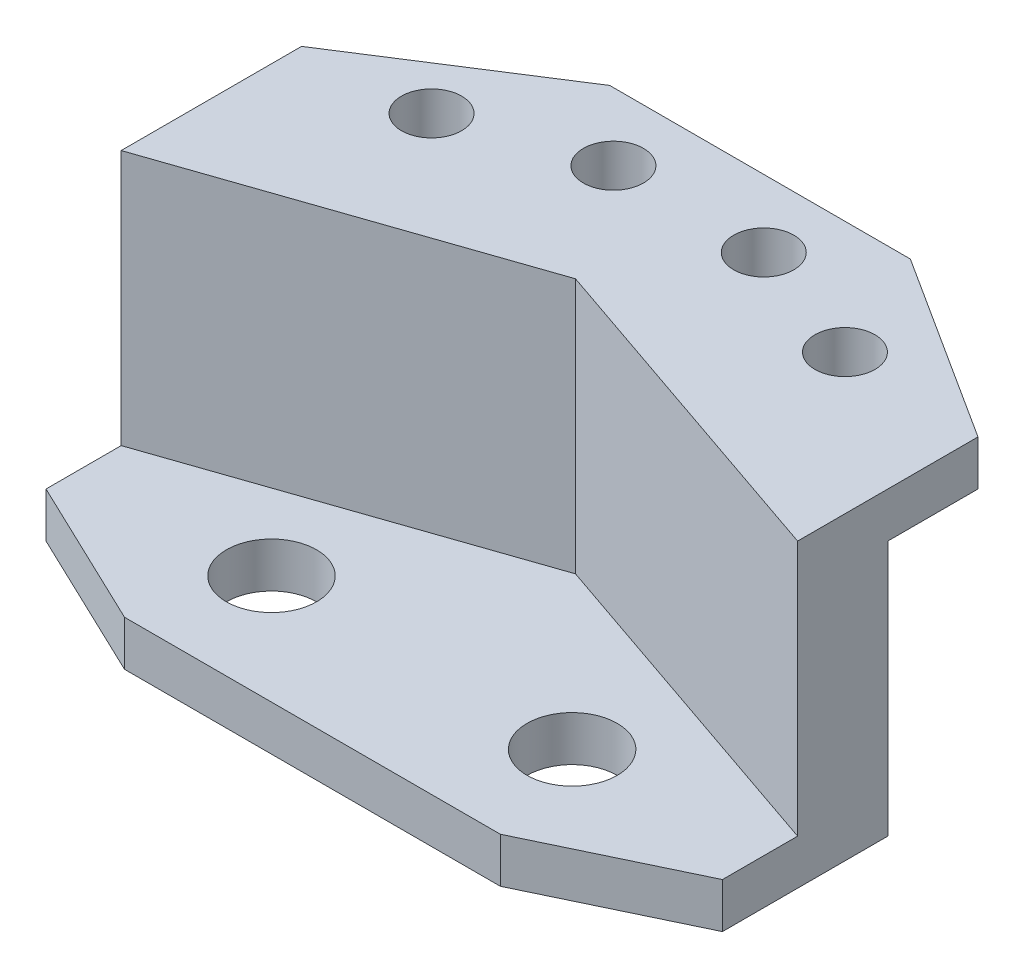
ISO-10303-21;
HEADER;
FILE_DESCRIPTION(('STEP AP214'),'2;1');
FILE_NAME('part.step','',(''),(''),'','','');
FILE_SCHEMA(('AUTOMOTIVE_DESIGN { 1 0 10303 214 1 1 1 1 }'));
ENDSEC;
DATA;
#1=APPLICATION_CONTEXT('core data for automotive mechanical design processes');
#2=APPLICATION_PROTOCOL_DEFINITION('international standard','automotive_design',2000,#1);
#3=PRODUCT_CONTEXT('',#1,'mechanical');
#4=PRODUCT('Part','Part','',(#3));
#5=PRODUCT_RELATED_PRODUCT_CATEGORY('part','',(#4));
#6=PRODUCT_DEFINITION_FORMATION('','',#4);
#7=PRODUCT_DEFINITION_CONTEXT('part definition',#1,'design');
#8=PRODUCT_DEFINITION('design','',#6,#7);
#9=PRODUCT_DEFINITION_SHAPE('','',#8);
#10=(LENGTH_UNIT() NAMED_UNIT(*) SI_UNIT(.MILLI.,.METRE.));
#11=(NAMED_UNIT(*) PLANE_ANGLE_UNIT() SI_UNIT($,.RADIAN.));
#12=(NAMED_UNIT(*) SI_UNIT($,.STERADIAN.) SOLID_ANGLE_UNIT());
#13=UNCERTAINTY_MEASURE_WITH_UNIT(LENGTH_MEASURE(1.E-05),#10,'distance_accuracy_value','');
#14=(GEOMETRIC_REPRESENTATION_CONTEXT(3) GLOBAL_UNCERTAINTY_ASSIGNED_CONTEXT((#13)) GLOBAL_UNIT_ASSIGNED_CONTEXT((#10,
#11,#12)) REPRESENTATION_CONTEXT('',''));
#15=CARTESIAN_POINT('',(0.,0.,0.));
#16=DIRECTION('',(0.,0.,1.));
#17=DIRECTION('',(1.,0.,0.));
#18=AXIS2_PLACEMENT_3D('',#15,#16,#17);
#19=CARTESIAN_POINT('',(0.,6.,0.));
#20=DIRECTION('',(0.,1.,0.));
#21=DIRECTION('',(0.,0.,1.));
#22=AXIS2_PLACEMENT_3D('',#19,#20,#21);
#23=PLANE('',#22);
#24=CARTESIAN_POINT('',(2.60978640543371,6.,-14.5531294046448));
#25=DIRECTION('',(0.,1.,0.));
#26=DIRECTION('',(0.,0.,1.));
#27=AXIS2_PLACEMENT_3D('',#24,#25,#26);
#28=CIRCLE('',#27,6.);
#29=CARTESIAN_POINT('',(2.60978640543371,6.,-8.55312940464484));
#30=VERTEX_POINT('',#29);
#31=EDGE_CURVE('E151',#30,#30,#28,.T.);
#32=ORIENTED_EDGE('',*,*,#31,.F.);
#33=EDGE_LOOP('',(#32));
#34=FACE_BOUND('',#33,.T.);
#35=DIRECTION('',(0.,0.,1.));
#36=VECTOR('',#35,1.);
#37=CARTESIAN_POINT('',(-22.3902135945663,6.,-19.5531294046448));
#38=LINE('',#37,#36);
#39=CARTESIAN_POINT('',(-22.3902135945663,6.,-19.5531294046448));
#40=VERTEX_POINT('',#39);
#41=CARTESIAN_POINT('',(-22.3902135945663,6.,-9.55312940464485));
#42=VERTEX_POINT('',#41);
#43=EDGE_CURVE('E157',#40,#42,#38,.T.);
#44=ORIENTED_EDGE('',*,*,#43,.T.);
#45=DIRECTION('',(0.902346390172636,0.,0.431011591656667));
#46=VECTOR('',#45,1.);
#47=CARTESIAN_POINT('',(-22.3902135945663,6.,-9.55312940464485));
#48=LINE('',#47,#46);
#49=CARTESIAN_POINT('',(-2.39021359456628,6.,0.));
#50=VERTEX_POINT('',#49);
#51=EDGE_CURVE('E88',#42,#50,#48,.T.);
#52=ORIENTED_EDGE('',*,*,#51,.T.);
#53=DIRECTION('',(1.,0.,0.));
#54=VECTOR('',#53,1.);
#55=CARTESIAN_POINT('',(-2.39021359456628,6.,0.));
#56=LINE('',#55,#54);
#57=CARTESIAN_POINT('',(47.6097864054337,6.,0.));
#58=VERTEX_POINT('',#57);
#59=EDGE_CURVE('E161',#50,#58,#56,.T.);
#60=ORIENTED_EDGE('',*,*,#59,.T.);
#61=DIRECTION('',(0.902346390172636,0.,-0.431011591656667));
#62=VECTOR('',#61,1.);
#63=CARTESIAN_POINT('',(67.6097864054337,6.,-9.55312940464484));
#64=LINE('',#63,#62);
#65=CARTESIAN_POINT('',(67.6097864054337,6.,-9.55312940464484));
#66=VERTEX_POINT('',#65);
#67=EDGE_CURVE('E105',#58,#66,#64,.T.);
#68=ORIENTED_EDGE('',*,*,#67,.T.);
#69=DIRECTION('',(0.,0.,-1.));
#70=VECTOR('',#69,1.);
#71=CARTESIAN_POINT('',(67.6097864054337,6.,-19.5531294046448));
#72=LINE('',#71,#70);
#73=CARTESIAN_POINT('',(67.6097864054337,6.,-19.5531294046448));
#74=VERTEX_POINT('',#73);
#75=EDGE_CURVE('E100',#66,#74,#72,.T.);
#76=ORIENTED_EDGE('',*,*,#75,.T.);
#77=DIRECTION('',(-0.945827884764165,0.,-0.324668465365123));
#78=VECTOR('',#77,1.);
#79=CARTESIAN_POINT('',(22.6097864054337,6.,-35.));
#80=LINE('',#79,#78);
#81=CARTESIAN_POINT('',(22.6097864054337,6.,-35.));
#82=VERTEX_POINT('',#81);
#83=EDGE_CURVE('E103',#74,#82,#80,.T.);
#84=ORIENTED_EDGE('',*,*,#83,.T.);
#85=DIRECTION('',(-0.945827884764166,0.,0.324668465365124));
#86=VECTOR('',#85,1.);
#87=CARTESIAN_POINT('',(-22.3902135945663,6.,-19.5531294046448));
#88=LINE('',#87,#86);
#89=EDGE_CURVE('E55',#82,#40,#88,.T.);
#90=ORIENTED_EDGE('',*,*,#89,.T.);
#91=EDGE_LOOP('',(#44,#52,#60,#68,#76,#84,#90));
#92=FACE_BOUND('',#91,.T.);
#93=CARTESIAN_POINT('',(42.6097864054337,6.,-14.5531294046448));
#94=DIRECTION('',(0.,1.,0.));
#95=DIRECTION('',(0.,0.,-1.));
#96=AXIS2_PLACEMENT_3D('',#93,#94,#95);
#97=CIRCLE('',#96,6.);
#98=CARTESIAN_POINT('',(42.6097864054337,6.,-20.5531294046448));
#99=VERTEX_POINT('',#98);
#100=EDGE_CURVE('E129',#99,#99,#97,.T.);
#101=ORIENTED_EDGE('',*,*,#100,.F.);
#102=EDGE_LOOP('',(#101));
#103=FACE_BOUND('',#102,.T.);
#104=ADVANCED_FACE('F38',(#34,#92,#103),#23,.T.);
#105=CARTESIAN_POINT('',(0.,0.,0.));
#106=DIRECTION('',(0.,1.,0.));
#107=DIRECTION('',(0.,0.,1.));
#108=AXIS2_PLACEMENT_3D('',#105,#106,#107);
#109=PLANE('',#108);
#110=DIRECTION('',(0.,0.,1.));
#111=VECTOR('',#110,1.);
#112=CARTESIAN_POINT('',(-22.3902135945663,0.,-19.5531294046448));
#113=LINE('',#112,#111);
#114=CARTESIAN_POINT('',(-22.3902135945663,0.,-31.5531294046448));
#115=VERTEX_POINT('',#114);
#116=CARTESIAN_POINT('',(-22.3902135945663,0.,-9.55312940464485));
#117=VERTEX_POINT('',#116);
#118=EDGE_CURVE('E154',#115,#117,#113,.T.);
#119=ORIENTED_EDGE('',*,*,#118,.F.);
#120=DIRECTION('',(0.945827884764166,0.,-0.324668465365124));
#121=VECTOR('',#120,1.);
#122=CARTESIAN_POINT('',(-12.0494941072573,0.,-35.1027239776077));
#123=LINE('',#122,#121);
#124=CARTESIAN_POINT('',(22.6097864054337,0.,-47.));
#125=VERTEX_POINT('',#124);
#126=EDGE_CURVE('E134',#115,#125,#123,.T.);
#127=ORIENTED_EDGE('',*,*,#126,.T.);
#128=DIRECTION('',(0.945827884764166,0.,0.324668465365123));
#129=VECTOR('',#128,1.);
#130=CARTESIAN_POINT('',(16.8160717502594,0.,-48.9887724565531));
#131=LINE('',#130,#129);
#132=CARTESIAN_POINT('',(67.6097864054337,0.,-31.5531294046449));
#133=VERTEX_POINT('',#132);
#134=EDGE_CURVE('E186',#125,#133,#131,.T.);
#135=ORIENTED_EDGE('',*,*,#134,.T.);
#136=DIRECTION('',(0.,0.,-1.));
#137=VECTOR('',#136,1.);
#138=CARTESIAN_POINT('',(67.6097864054337,0.,-19.5531294046448));
#139=LINE('',#138,#137);
#140=CARTESIAN_POINT('',(67.6097864054337,0.,-9.55312940464484));
#141=VERTEX_POINT('',#140);
#142=EDGE_CURVE('E159',#141,#133,#139,.T.);
#143=ORIENTED_EDGE('',*,*,#142,.F.);
#144=DIRECTION('',(0.902346390172636,0.,-0.431011591656667));
#145=VECTOR('',#144,1.);
#146=CARTESIAN_POINT('',(67.6097864054337,0.,-9.55312940464484));
#147=LINE('',#146,#145);
#148=CARTESIAN_POINT('',(47.6097864054337,0.,0.));
#149=VERTEX_POINT('',#148);
#150=EDGE_CURVE('E80',#149,#141,#147,.T.);
#151=ORIENTED_EDGE('',*,*,#150,.F.);
#152=DIRECTION('',(1.,0.,0.));
#153=VECTOR('',#152,1.);
#154=CARTESIAN_POINT('',(-2.39021359456628,0.,0.));
#155=LINE('',#154,#153);
#156=CARTESIAN_POINT('',(-2.39021359456628,0.,0.));
#157=VERTEX_POINT('',#156);
#158=EDGE_CURVE('E73',#157,#149,#155,.T.);
#159=ORIENTED_EDGE('',*,*,#158,.F.);
#160=DIRECTION('',(0.902346390172636,0.,0.431011591656667));
#161=VECTOR('',#160,1.);
#162=CARTESIAN_POINT('',(-22.3902135945663,0.,-9.55312940464485));
#163=LINE('',#162,#161);
#164=EDGE_CURVE('E168',#117,#157,#163,.T.);
#165=ORIENTED_EDGE('',*,*,#164,.F.);
#166=EDGE_LOOP('',(#119,#127,#135,#143,#151,#159,#165));
#167=FACE_BOUND('',#166,.T.);
#168=CARTESIAN_POINT('',(2.60978640543371,0.,-14.5531294046448));
#169=DIRECTION('',(0.,1.,0.));
#170=DIRECTION('',(0.,0.,1.));
#171=AXIS2_PLACEMENT_3D('',#168,#169,#170);
#172=CIRCLE('',#171,6.);
#173=CARTESIAN_POINT('',(2.60978640543371,0.,-8.55312940464484));
#174=VERTEX_POINT('',#173);
#175=EDGE_CURVE('E149',#174,#174,#172,.T.);
#176=ORIENTED_EDGE('',*,*,#175,.T.);
#177=EDGE_LOOP('',(#176));
#178=FACE_BOUND('',#177,.T.);
#179=CARTESIAN_POINT('',(42.6097864054337,0.,-14.5531294046448));
#180=DIRECTION('',(0.,1.,0.));
#181=DIRECTION('',(0.,0.,-1.));
#182=AXIS2_PLACEMENT_3D('',#179,#180,#181);
#183=CIRCLE('',#182,6.);
#184=CARTESIAN_POINT('',(42.6097864054337,0.,-20.5531294046448));
#185=VERTEX_POINT('',#184);
#186=EDGE_CURVE('E126',#185,#185,#183,.T.);
#187=ORIENTED_EDGE('',*,*,#186,.T.);
#188=EDGE_LOOP('',(#187));
#189=FACE_BOUND('',#188,.T.);
#190=ADVANCED_FACE('F179',(#167,#178,#189),#109,.F.);
#191=CARTESIAN_POINT('',(-22.3902135945663,6.,-19.5531294046448));
#192=DIRECTION('',(1.,0.,0.));
#193=DIRECTION('',(0.,0.,-1.));
#194=AXIS2_PLACEMENT_3D('',#191,#192,#193);
#195=PLANE('',#194);
#196=ORIENTED_EDGE('',*,*,#118,.T.);
#197=DIRECTION('',(0.,-1.,0.));
#198=VECTOR('',#197,1.);
#199=CARTESIAN_POINT('',(-22.3902135945663,6.,-9.55312940464485));
#200=LINE('',#199,#198);
#201=EDGE_CURVE('E11',#42,#117,#200,.T.);
#202=ORIENTED_EDGE('',*,*,#201,.F.);
#203=ORIENTED_EDGE('',*,*,#43,.F.);
#204=DIRECTION('',(0.,1.,0.));
#205=VECTOR('',#204,1.);
#206=CARTESIAN_POINT('',(-22.3902135945663,0.,-19.5531294046448));
#207=LINE('',#206,#205);
#208=CARTESIAN_POINT('',(-22.3902135945663,40.,-19.5531294046448));
#209=VERTEX_POINT('',#208);
#210=EDGE_CURVE('E131',#40,#209,#207,.T.);
#211=ORIENTED_EDGE('',*,*,#210,.T.);
#212=DIRECTION('',(0.,0.,-1.));
#213=VECTOR('',#212,1.);
#214=CARTESIAN_POINT('',(-22.3902135945663,40.,0.));
#215=LINE('',#214,#213);
#216=CARTESIAN_POINT('',(-22.3902135945663,40.,-43.5531294046448));
#217=VERTEX_POINT('',#216);
#218=EDGE_CURVE('E235',#209,#217,#215,.T.);
#219=ORIENTED_EDGE('',*,*,#218,.T.);
#220=DIRECTION('',(0.,-1.,0.));
#221=VECTOR('',#220,1.);
#222=CARTESIAN_POINT('',(-22.3902135945663,40.,-43.5531294046448));
#223=LINE('',#222,#221);
#224=CARTESIAN_POINT('',(-22.3902135945663,34.,-43.5531294046448));
#225=VERTEX_POINT('',#224);
#226=EDGE_CURVE('E277',#217,#225,#223,.T.);
#227=ORIENTED_EDGE('',*,*,#226,.T.);
#228=DIRECTION('',(0.,0.,-1.));
#229=VECTOR('',#228,1.);
#230=CARTESIAN_POINT('',(-22.3902135945663,34.,0.));
#231=LINE('',#230,#229);
#232=CARTESIAN_POINT('',(-22.3902135945663,34.,-31.5531294046448));
#233=VERTEX_POINT('',#232);
#234=EDGE_CURVE('E278',#233,#225,#231,.T.);
#235=ORIENTED_EDGE('',*,*,#234,.F.);
#236=DIRECTION('',(0.,1.,0.));
#237=VECTOR('',#236,1.);
#238=CARTESIAN_POINT('',(-22.3902135945663,0.,-31.5531294046448));
#239=LINE('',#238,#237);
#240=EDGE_CURVE('E139',#115,#233,#239,.T.);
#241=ORIENTED_EDGE('',*,*,#240,.F.);
#242=EDGE_LOOP('',(#196,#202,#203,#211,#219,#227,#235,#241));
#243=FACE_BOUND('',#242,.T.);
#244=ADVANCED_FACE('F40',(#243),#195,.F.);
#245=CARTESIAN_POINT('',(-22.3902135945663,6.,-9.55312940464485));
#246=DIRECTION('',(0.431011591656667,0.,-0.902346390172636));
#247=DIRECTION('',(-0.902346390172636,0.,-0.431011591656667));
#248=AXIS2_PLACEMENT_3D('',#245,#246,#247);
#249=PLANE('',#248);
#250=ORIENTED_EDGE('',*,*,#164,.T.);
#251=DIRECTION('',(0.,-1.,0.));
#252=VECTOR('',#251,1.);
#253=CARTESIAN_POINT('',(-2.39021359456628,6.,0.));
#254=LINE('',#253,#252);
#255=EDGE_CURVE('E47',#50,#157,#254,.T.);
#256=ORIENTED_EDGE('',*,*,#255,.F.);
#257=ORIENTED_EDGE('',*,*,#51,.F.);
#258=ORIENTED_EDGE('',*,*,#201,.T.);
#259=EDGE_LOOP('',(#250,#256,#257,#258));
#260=FACE_BOUND('',#259,.T.);
#261=ADVANCED_FACE('F331',(#260),#249,.F.);
#262=CARTESIAN_POINT('',(-2.39021359456628,6.,0.));
#263=DIRECTION('',(0.,0.,-1.));
#264=DIRECTION('',(-1.,0.,0.));
#265=AXIS2_PLACEMENT_3D('',#262,#263,#264);
#266=PLANE('',#265);
#267=ORIENTED_EDGE('',*,*,#158,.T.);
#268=DIRECTION('',(0.,-1.,0.));
#269=VECTOR('',#268,1.);
#270=CARTESIAN_POINT('',(47.6097864054337,6.,0.));
#271=LINE('',#270,#269);
#272=EDGE_CURVE('E174',#58,#149,#271,.T.);
#273=ORIENTED_EDGE('',*,*,#272,.F.);
#274=ORIENTED_EDGE('',*,*,#59,.F.);
#275=ORIENTED_EDGE('',*,*,#255,.T.);
#276=EDGE_LOOP('',(#267,#273,#274,#275));
#277=FACE_BOUND('',#276,.T.);
#278=ADVANCED_FACE('F176',(#277),#266,.F.);
#279=CARTESIAN_POINT('',(67.6097864054337,6.,-9.55312940464484));
#280=DIRECTION('',(-0.431011591656667,0.,-0.902346390172636));
#281=DIRECTION('',(-0.902346390172636,0.,0.431011591656667));
#282=AXIS2_PLACEMENT_3D('',#279,#280,#281);
#283=PLANE('',#282);
#284=ORIENTED_EDGE('',*,*,#150,.T.);
#285=DIRECTION('',(0.,-1.,0.));
#286=VECTOR('',#285,1.);
#287=CARTESIAN_POINT('',(67.6097864054337,6.,-9.55312940464484));
#288=LINE('',#287,#286);
#289=EDGE_CURVE('E165',#66,#141,#288,.T.);
#290=ORIENTED_EDGE('',*,*,#289,.F.);
#291=ORIENTED_EDGE('',*,*,#67,.F.);
#292=ORIENTED_EDGE('',*,*,#272,.T.);
#293=EDGE_LOOP('',(#284,#290,#291,#292));
#294=FACE_BOUND('',#293,.T.);
#295=ADVANCED_FACE('F337',(#294),#283,.F.);
#296=CARTESIAN_POINT('',(67.6097864054337,6.,-19.5531294046448));
#297=DIRECTION('',(-1.,0.,0.));
#298=DIRECTION('',(0.,0.,1.));
#299=AXIS2_PLACEMENT_3D('',#296,#297,#298);
#300=PLANE('',#299);
#301=ORIENTED_EDGE('',*,*,#142,.T.);
#302=DIRECTION('',(0.,1.,0.));
#303=VECTOR('',#302,1.);
#304=CARTESIAN_POINT('',(67.6097864054337,0.,-31.5531294046449));
#305=LINE('',#304,#303);
#306=CARTESIAN_POINT('',(67.6097864054337,34.,-31.5531294046448));
#307=VERTEX_POINT('',#306);
#308=EDGE_CURVE('E145',#133,#307,#305,.T.);
#309=ORIENTED_EDGE('',*,*,#308,.T.);
#310=DIRECTION('',(0.,0.,1.));
#311=VECTOR('',#310,1.);
#312=CARTESIAN_POINT('',(67.6097864054338,34.,-1.56379044911045E-13));
#313=LINE('',#312,#311);
#314=CARTESIAN_POINT('',(67.6097864054337,34.,-43.5531294046448));
#315=VERTEX_POINT('',#314);
#316=EDGE_CURVE('E280',#315,#307,#313,.T.);
#317=ORIENTED_EDGE('',*,*,#316,.F.);
#318=DIRECTION('',(0.,-1.,0.));
#319=VECTOR('',#318,1.);
#320=CARTESIAN_POINT('',(67.6097864054337,40.,-43.5531294046448));
#321=LINE('',#320,#319);
#322=CARTESIAN_POINT('',(67.6097864054337,40.,-43.5531294046448));
#323=VERTEX_POINT('',#322);
#324=EDGE_CURVE('E304',#323,#315,#321,.T.);
#325=ORIENTED_EDGE('',*,*,#324,.F.);
#326=DIRECTION('',(0.,0.,1.));
#327=VECTOR('',#326,1.);
#328=CARTESIAN_POINT('',(67.6097864054338,40.,-1.56379044911045E-13));
#329=LINE('',#328,#327);
#330=CARTESIAN_POINT('',(67.6097864054337,40.,-19.5531294046449));
#331=VERTEX_POINT('',#330);
#332=EDGE_CURVE('E125',#323,#331,#329,.T.);
#333=ORIENTED_EDGE('',*,*,#332,.T.);
#334=DIRECTION('',(0.,1.,0.));
#335=VECTOR('',#334,1.);
#336=CARTESIAN_POINT('',(67.6097864054337,0.,-19.5531294046449));
#337=LINE('',#336,#335);
#338=EDGE_CURVE('E115',#74,#331,#337,.T.);
#339=ORIENTED_EDGE('',*,*,#338,.F.);
#340=ORIENTED_EDGE('',*,*,#75,.F.);
#341=ORIENTED_EDGE('',*,*,#289,.T.);
#342=EDGE_LOOP('',(#301,#309,#317,#325,#333,#339,#340,#341));
#343=FACE_BOUND('',#342,.T.);
#344=ADVANCED_FACE('F122',(#343),#300,.F.);
#345=CARTESIAN_POINT('',(2.60978640543371,6.,-14.5531294046448));
#346=DIRECTION('',(0.,-1.,0.));
#347=DIRECTION('',(0.,0.,-1.));
#348=AXIS2_PLACEMENT_3D('',#345,#346,#347);
#349=CYLINDRICAL_SURFACE('',#348,6.);
#350=ORIENTED_EDGE('',*,*,#31,.T.);
#351=EDGE_LOOP('',(#350));
#352=FACE_BOUND('',#351,.T.);
#353=ORIENTED_EDGE('',*,*,#175,.F.);
#354=EDGE_LOOP('',(#353));
#355=FACE_BOUND('',#354,.T.);
#356=ADVANCED_FACE('F348',(#352,#355),#349,.F.);
#357=CARTESIAN_POINT('',(42.6097864054337,6.,-14.5531294046448));
#358=DIRECTION('',(0.,-1.,0.));
#359=DIRECTION('',(0.,0.,-1.));
#360=AXIS2_PLACEMENT_3D('',#357,#358,#359);
#361=CYLINDRICAL_SURFACE('',#360,6.);
#362=ORIENTED_EDGE('',*,*,#100,.T.);
#363=EDGE_LOOP('',(#362));
#364=FACE_BOUND('',#363,.T.);
#365=ORIENTED_EDGE('',*,*,#186,.F.);
#366=EDGE_LOOP('',(#365));
#367=FACE_BOUND('',#366,.T.);
#368=ADVANCED_FACE('F370',(#364,#367),#361,.F.);
#369=CARTESIAN_POINT('',(13.1311058961084,0.,-38.2536878053836));
#370=DIRECTION('',(0.324668465365123,0.,-0.945827884764165));
#371=DIRECTION('',(-0.945827884764166,0.,-0.324668465365123));
#372=AXIS2_PLACEMENT_3D('',#369,#370,#371);
#373=PLANE('',#372);
#374=ORIENTED_EDGE('',*,*,#83,.F.);
#375=ORIENTED_EDGE('',*,*,#338,.T.);
#376=DIRECTION('',(0.945827884764166,0.,0.324668465365123));
#377=VECTOR('',#376,1.);
#378=CARTESIAN_POINT('',(13.1311058961084,40.,-38.2536878053836));
#379=LINE('',#378,#377);
#380=CARTESIAN_POINT('',(22.6097864054337,40.,-35.));
#381=VERTEX_POINT('',#380);
#382=EDGE_CURVE('E243',#381,#331,#379,.T.);
#383=ORIENTED_EDGE('',*,*,#382,.F.);
#384=DIRECTION('',(0.,1.,0.));
#385=VECTOR('',#384,1.);
#386=CARTESIAN_POINT('',(22.6097864054337,0.,-35.));
#387=LINE('',#386,#385);
#388=EDGE_CURVE('E118',#82,#381,#387,.T.);
#389=ORIENTED_EDGE('',*,*,#388,.F.);
#390=EDGE_LOOP('',(#374,#375,#383,#389));
#391=FACE_BOUND('',#390,.T.);
#392=ADVANCED_FACE('F112',(#391),#373,.F.);
#393=CARTESIAN_POINT('',(-8.3645282531062,0.,-24.3676393264383));
#394=DIRECTION('',(-0.324668465365123,0.,-0.945827884764165));
#395=DIRECTION('',(-0.945827884764166,0.,0.324668465365123));
#396=AXIS2_PLACEMENT_3D('',#393,#394,#395);
#397=PLANE('',#396);
#398=ORIENTED_EDGE('',*,*,#89,.F.);
#399=ORIENTED_EDGE('',*,*,#388,.T.);
#400=DIRECTION('',(0.945827884764166,0.,-0.324668465365123));
#401=VECTOR('',#400,1.);
#402=CARTESIAN_POINT('',(-8.3645282531062,40.,-24.3676393264383));
#403=LINE('',#402,#401);
#404=EDGE_CURVE('E240',#209,#381,#403,.T.);
#405=ORIENTED_EDGE('',*,*,#404,.F.);
#406=ORIENTED_EDGE('',*,*,#210,.F.);
#407=EDGE_LOOP('',(#398,#399,#405,#406));
#408=FACE_BOUND('',#407,.T.);
#409=ADVANCED_FACE('F241',(#408),#397,.F.);
#410=CARTESIAN_POINT('',(-12.0494941072573,0.,-35.1027239776077));
#411=DIRECTION('',(0.324668465365124,0.,0.945827884764165));
#412=DIRECTION('',(0.945827884764165,0.,-0.324668465365124));
#413=AXIS2_PLACEMENT_3D('',#410,#411,#412);
#414=PLANE('',#413);
#415=ORIENTED_EDGE('',*,*,#240,.T.);
#416=DIRECTION('',(0.945827884764166,0.,-0.324668465365124));
#417=VECTOR('',#416,1.);
#418=CARTESIAN_POINT('',(-12.0494941072573,34.,-35.1027239776077));
#419=LINE('',#418,#417);
#420=CARTESIAN_POINT('',(22.6097864054337,34.,-47.));
#421=VERTEX_POINT('',#420);
#422=EDGE_CURVE('E308',#233,#421,#419,.T.);
#423=ORIENTED_EDGE('',*,*,#422,.T.);
#424=DIRECTION('',(0.,1.,0.));
#425=VECTOR('',#424,1.);
#426=CARTESIAN_POINT('',(22.6097864054337,0.,-47.));
#427=LINE('',#426,#425);
#428=EDGE_CURVE('E142',#125,#421,#427,.T.);
#429=ORIENTED_EDGE('',*,*,#428,.F.);
#430=ORIENTED_EDGE('',*,*,#126,.F.);
#431=EDGE_LOOP('',(#415,#423,#429,#430));
#432=FACE_BOUND('',#431,.T.);
#433=ADVANCED_FACE('F314',(#432),#414,.F.);
#434=CARTESIAN_POINT('',(16.8160717502594,0.,-48.9887724565531));
#435=DIRECTION('',(-0.324668465365123,0.,0.945827884764166));
#436=DIRECTION('',(0.945827884764166,0.,0.324668465365123));
#437=AXIS2_PLACEMENT_3D('',#434,#435,#436);
#438=PLANE('',#437);
#439=ORIENTED_EDGE('',*,*,#428,.T.);
#440=DIRECTION('',(0.945827884764166,0.,0.324668465365123));
#441=VECTOR('',#440,1.);
#442=CARTESIAN_POINT('',(16.8160717502594,34.,-48.9887724565531));
#443=LINE('',#442,#441);
#444=EDGE_CURVE('E306',#421,#307,#443,.T.);
#445=ORIENTED_EDGE('',*,*,#444,.T.);
#446=ORIENTED_EDGE('',*,*,#308,.F.);
#447=ORIENTED_EDGE('',*,*,#134,.F.);
#448=EDGE_LOOP('',(#439,#445,#446,#447));
#449=FACE_BOUND('',#448,.T.);
#450=ADVANCED_FACE('F316',(#449),#438,.F.);
#451=CARTESIAN_POINT('',(39.4203826125414,40.,-61.5943478320959));
#452=DIRECTION('',(0.539053696423367,0.,-0.842271400661512));
#453=DIRECTION('',(-0.842271400661512,0.,-0.539053696423367));
#454=AXIS2_PLACEMENT_3D('',#451,#452,#453);
#455=PLANE('',#454);
#456=DIRECTION('',(0.842271400661511,0.,0.539053696423367));
#457=VECTOR('',#456,1.);
#458=CARTESIAN_POINT('',(39.4203826125414,34.,-61.5943478320959));
#459=LINE('',#458,#457);
#460=CARTESIAN_POINT('',(42.6097864054337,34.,-59.5531294046448));
#461=VERTEX_POINT('',#460);
#462=EDGE_CURVE('E282',#461,#315,#459,.T.);
#463=ORIENTED_EDGE('',*,*,#462,.F.);
#464=DIRECTION('',(0.,-1.,0.));
#465=VECTOR('',#464,1.);
#466=CARTESIAN_POINT('',(42.6097864054337,40.,-59.5531294046448));
#467=LINE('',#466,#465);
#468=CARTESIAN_POINT('',(42.6097864054337,40.,-59.5531294046448));
#469=VERTEX_POINT('',#468);
#470=EDGE_CURVE('E302',#469,#461,#467,.T.);
#471=ORIENTED_EDGE('',*,*,#470,.F.);
#472=DIRECTION('',(0.842271400661511,0.,0.539053696423367));
#473=VECTOR('',#472,1.);
#474=CARTESIAN_POINT('',(39.4203826125414,40.,-61.5943478320959));
#475=LINE('',#474,#473);
#476=EDGE_CURVE('E258',#469,#323,#475,.T.);
#477=ORIENTED_EDGE('',*,*,#476,.T.);
#478=ORIENTED_EDGE('',*,*,#324,.T.);
#479=EDGE_LOOP('',(#463,#471,#477,#478));
#480=FACE_BOUND('',#479,.T.);
#481=ADVANCED_FACE('F324',(#480),#455,.T.);
#482=CARTESIAN_POINT('',(0.,40.,-59.5531294046448));
#483=DIRECTION('',(0.,0.,-1.));
#484=DIRECTION('',(-1.,0.,0.));
#485=AXIS2_PLACEMENT_3D('',#482,#483,#484);
#486=PLANE('',#485);
#487=DIRECTION('',(1.,0.,0.));
#488=VECTOR('',#487,1.);
#489=CARTESIAN_POINT('',(0.,34.,-59.5531294046448));
#490=LINE('',#489,#488);
#491=CARTESIAN_POINT('',(2.6097864054337,34.,-59.5531294046448));
#492=VERTEX_POINT('',#491);
#493=EDGE_CURVE('E285',#492,#461,#490,.T.);
#494=ORIENTED_EDGE('',*,*,#493,.F.);
#495=DIRECTION('',(0.,-1.,0.));
#496=VECTOR('',#495,1.);
#497=CARTESIAN_POINT('',(2.6097864054337,40.,-59.5531294046448));
#498=LINE('',#497,#496);
#499=CARTESIAN_POINT('',(2.6097864054337,40.,-59.5531294046448));
#500=VERTEX_POINT('',#499);
#501=EDGE_CURVE('E300',#500,#492,#498,.T.);
#502=ORIENTED_EDGE('',*,*,#501,.F.);
#503=DIRECTION('',(1.,0.,0.));
#504=VECTOR('',#503,1.);
#505=CARTESIAN_POINT('',(0.,40.,-59.5531294046448));
#506=LINE('',#505,#504);
#507=EDGE_CURVE('E261',#500,#469,#506,.T.);
#508=ORIENTED_EDGE('',*,*,#507,.T.);
#509=ORIENTED_EDGE('',*,*,#470,.T.);
#510=EDGE_LOOP('',(#494,#502,#508,#509));
#511=FACE_BOUND('',#510,.T.);
#512=ADVANCED_FACE('F327',(#511),#486,.T.);
#513=CARTESIAN_POINT('',(32.1060063425379,40.,-50.5531294046448));
#514=DIRECTION('',(0.,-1.,0.));
#515=DIRECTION('',(0.,0.,-1.));
#516=AXIS2_PLACEMENT_3D('',#513,#514,#515);
#517=CYLINDRICAL_SURFACE('',#516,4.00000000000001);
#518=CARTESIAN_POINT('',(32.1060063425379,40.,-50.5531294046448));
#519=DIRECTION('',(0.,1.,0.));
#520=DIRECTION('',(0.,0.,1.));
#521=AXIS2_PLACEMENT_3D('',#518,#519,#520);
#522=CIRCLE('',#521,4.00000000000001);
#523=CARTESIAN_POINT('',(32.1060063425379,40.,-46.5531294046448));
#524=VERTEX_POINT('',#523);
#525=EDGE_CURVE('E271',#524,#524,#522,.T.);
#526=ORIENTED_EDGE('',*,*,#525,.T.);
#527=EDGE_LOOP('',(#526));
#528=FACE_BOUND('',#527,.T.);
#529=CARTESIAN_POINT('',(32.1060063425379,34.,-50.5531294046448));
#530=DIRECTION('',(0.,1.,0.));
#531=DIRECTION('',(0.,0.,1.));
#532=AXIS2_PLACEMENT_3D('',#529,#530,#531);
#533=CIRCLE('',#532,4.00000000000001);
#534=CARTESIAN_POINT('',(32.1060063425379,34.,-46.5531294046448));
#535=VERTEX_POINT('',#534);
#536=EDGE_CURVE('E253',#535,#535,#533,.T.);
#537=ORIENTED_EDGE('',*,*,#536,.F.);
#538=EDGE_LOOP('',(#537));
#539=FACE_BOUND('',#538,.T.);
#540=ADVANCED_FACE('F412',(#528,#539),#517,.F.);
#541=CARTESIAN_POINT('',(-6.01656367394288,40.,-44.4777361800821));
#542=DIRECTION('',(0.,-1.,0.));
#543=DIRECTION('',(0.,0.,-1.));
#544=AXIS2_PLACEMENT_3D('',#541,#542,#543);
#545=CYLINDRICAL_SURFACE('',#544,4.);
#546=CARTESIAN_POINT('',(-6.01656367394288,40.,-44.4777361800821));
#547=DIRECTION('',(0.,1.,0.));
#548=DIRECTION('',(0.,0.,1.));
#549=AXIS2_PLACEMENT_3D('',#546,#547,#548);
#550=CIRCLE('',#549,4.);
#551=CARTESIAN_POINT('',(-6.01656367394288,40.,-40.4777361800821));
#552=VERTEX_POINT('',#551);
#553=EDGE_CURVE('E268',#552,#552,#550,.T.);
#554=ORIENTED_EDGE('',*,*,#553,.T.);
#555=EDGE_LOOP('',(#554));
#556=FACE_BOUND('',#555,.T.);
#557=CARTESIAN_POINT('',(-6.01656367394288,34.,-44.4777361800821));
#558=DIRECTION('',(0.,1.,0.));
#559=DIRECTION('',(0.,0.,1.));
#560=AXIS2_PLACEMENT_3D('',#557,#558,#559);
#561=CIRCLE('',#560,4.);
#562=CARTESIAN_POINT('',(-6.01656367394288,34.,-40.4777361800821));
#563=VERTEX_POINT('',#562);
#564=EDGE_CURVE('E294',#563,#563,#561,.T.);
#565=ORIENTED_EDGE('',*,*,#564,.F.);
#566=EDGE_LOOP('',(#565));
#567=FACE_BOUND('',#566,.T.);
#568=ADVANCED_FACE('F419',(#556,#567),#545,.F.);
#569=CARTESIAN_POINT('',(48.9834363260571,40.,-44.4777361800821));
#570=DIRECTION('',(0.,-1.,0.));
#571=DIRECTION('',(0.,0.,-1.));
#572=AXIS2_PLACEMENT_3D('',#569,#570,#571);
#573=CYLINDRICAL_SURFACE('',#572,4.00000000000001);
#574=CARTESIAN_POINT('',(48.9834363260571,40.,-44.4777361800821));
#575=DIRECTION('',(0.,1.,0.));
#576=DIRECTION('',(0.,0.,1.));
#577=AXIS2_PLACEMENT_3D('',#574,#575,#576);
#578=CIRCLE('',#577,4.00000000000001);
#579=CARTESIAN_POINT('',(48.9834363260571,40.,-40.4777361800821));
#580=VERTEX_POINT('',#579);
#581=EDGE_CURVE('E265',#580,#580,#578,.T.);
#582=ORIENTED_EDGE('',*,*,#581,.T.);
#583=EDGE_LOOP('',(#582));
#584=FACE_BOUND('',#583,.T.);
#585=CARTESIAN_POINT('',(48.9834363260571,34.,-44.4777361800821));
#586=DIRECTION('',(0.,1.,0.));
#587=DIRECTION('',(0.,0.,1.));
#588=AXIS2_PLACEMENT_3D('',#585,#586,#587);
#589=CIRCLE('',#588,4.00000000000001);
#590=CARTESIAN_POINT('',(48.9834363260571,34.,-40.4777361800821));
#591=VERTEX_POINT('',#590);
#592=EDGE_CURVE('E291',#591,#591,#589,.T.);
#593=ORIENTED_EDGE('',*,*,#592,.F.);
#594=EDGE_LOOP('',(#593));
#595=FACE_BOUND('',#594,.T.);
#596=ADVANCED_FACE('F427',(#584,#595),#573,.F.);
#597=CARTESIAN_POINT('',(-26.28052944616,40.,-41.0633272596249));
#598=DIRECTION('',(-0.539053696423368,0.,-0.842271400661511));
#599=DIRECTION('',(-0.842271400661511,0.,0.539053696423368));
#600=AXIS2_PLACEMENT_3D('',#597,#598,#599);
#601=PLANE('',#600);
#602=DIRECTION('',(0.842271400661511,0.,-0.539053696423368));
#603=VECTOR('',#602,1.);
#604=CARTESIAN_POINT('',(-26.28052944616,34.,-41.0633272596249));
#605=LINE('',#604,#603);
#606=EDGE_CURVE('E288',#225,#492,#605,.T.);
#607=ORIENTED_EDGE('',*,*,#606,.F.);
#608=ORIENTED_EDGE('',*,*,#226,.F.);
#609=DIRECTION('',(0.842271400661511,0.,-0.539053696423368));
#610=VECTOR('',#609,1.);
#611=CARTESIAN_POINT('',(-26.28052944616,40.,-41.0633272596249));
#612=LINE('',#611,#610);
#613=EDGE_CURVE('E249',#217,#500,#612,.T.);
#614=ORIENTED_EDGE('',*,*,#613,.T.);
#615=ORIENTED_EDGE('',*,*,#501,.T.);
#616=EDGE_LOOP('',(#607,#608,#614,#615));
#617=FACE_BOUND('',#616,.T.);
#618=ADVANCED_FACE('F330',(#617),#601,.T.);
#619=CARTESIAN_POINT('',(12.1060063425379,40.,-50.5531294046448));
#620=DIRECTION('',(0.,-1.,0.));
#621=DIRECTION('',(0.,0.,-1.));
#622=AXIS2_PLACEMENT_3D('',#619,#620,#621);
#623=CYLINDRICAL_SURFACE('',#622,4.);
#624=CARTESIAN_POINT('',(12.1060063425379,40.,-50.5531294046448));
#625=DIRECTION('',(0.,1.,0.));
#626=DIRECTION('',(0.,0.,1.));
#627=AXIS2_PLACEMENT_3D('',#624,#625,#626);
#628=CIRCLE('',#627,4.);
#629=CARTESIAN_POINT('',(12.1060063425379,40.,-46.5531294046448));
#630=VERTEX_POINT('',#629);
#631=EDGE_CURVE('E274',#630,#630,#628,.T.);
#632=ORIENTED_EDGE('',*,*,#631,.T.);
#633=EDGE_LOOP('',(#632));
#634=FACE_BOUND('',#633,.T.);
#635=CARTESIAN_POINT('',(12.1060063425379,34.,-50.5531294046448));
#636=DIRECTION('',(0.,1.,0.));
#637=DIRECTION('',(0.,0.,1.));
#638=AXIS2_PLACEMENT_3D('',#635,#636,#637);
#639=CIRCLE('',#638,4.);
#640=CARTESIAN_POINT('',(12.1060063425379,34.,-46.5531294046448));
#641=VERTEX_POINT('',#640);
#642=EDGE_CURVE('E250',#641,#641,#639,.T.);
#643=ORIENTED_EDGE('',*,*,#642,.F.);
#644=EDGE_LOOP('',(#643));
#645=FACE_BOUND('',#644,.T.);
#646=ADVANCED_FACE('F442',(#634,#645),#623,.F.);
#647=CARTESIAN_POINT('',(0.,40.,0.));
#648=DIRECTION('',(0.,1.,0.));
#649=DIRECTION('',(0.,0.,1.));
#650=AXIS2_PLACEMENT_3D('',#647,#648,#649);
#651=PLANE('',#650);
#652=ORIENTED_EDGE('',*,*,#218,.F.);
#653=ORIENTED_EDGE('',*,*,#404,.T.);
#654=ORIENTED_EDGE('',*,*,#382,.T.);
#655=ORIENTED_EDGE('',*,*,#332,.F.);
#656=ORIENTED_EDGE('',*,*,#476,.F.);
#657=ORIENTED_EDGE('',*,*,#507,.F.);
#658=ORIENTED_EDGE('',*,*,#613,.F.);
#659=EDGE_LOOP('',(#652,#653,#654,#655,#656,#657,#658));
#660=FACE_BOUND('',#659,.T.);
#661=ORIENTED_EDGE('',*,*,#581,.F.);
#662=EDGE_LOOP('',(#661));
#663=FACE_BOUND('',#662,.T.);
#664=ORIENTED_EDGE('',*,*,#553,.F.);
#665=EDGE_LOOP('',(#664));
#666=FACE_BOUND('',#665,.T.);
#667=ORIENTED_EDGE('',*,*,#525,.F.);
#668=EDGE_LOOP('',(#667));
#669=FACE_BOUND('',#668,.T.);
#670=ORIENTED_EDGE('',*,*,#631,.F.);
#671=EDGE_LOOP('',(#670));
#672=FACE_BOUND('',#671,.T.);
#673=ADVANCED_FACE('F245',(#660,#663,#666,#669,#672),#651,.T.);
#674=CARTESIAN_POINT('',(0.,34.,0.));
#675=DIRECTION('',(0.,1.,0.));
#676=DIRECTION('',(0.,0.,1.));
#677=AXIS2_PLACEMENT_3D('',#674,#675,#676);
#678=PLANE('',#677);
#679=ORIENTED_EDGE('',*,*,#444,.F.);
#680=ORIENTED_EDGE('',*,*,#422,.F.);
#681=ORIENTED_EDGE('',*,*,#234,.T.);
#682=ORIENTED_EDGE('',*,*,#606,.T.);
#683=ORIENTED_EDGE('',*,*,#493,.T.);
#684=ORIENTED_EDGE('',*,*,#462,.T.);
#685=ORIENTED_EDGE('',*,*,#316,.T.);
#686=EDGE_LOOP('',(#679,#680,#681,#682,#683,#684,#685));
#687=FACE_BOUND('',#686,.T.);
#688=ORIENTED_EDGE('',*,*,#592,.T.);
#689=EDGE_LOOP('',(#688));
#690=FACE_BOUND('',#689,.T.);
#691=ORIENTED_EDGE('',*,*,#564,.T.);
#692=EDGE_LOOP('',(#691));
#693=FACE_BOUND('',#692,.T.);
#694=ORIENTED_EDGE('',*,*,#536,.T.);
#695=EDGE_LOOP('',(#694));
#696=FACE_BOUND('',#695,.T.);
#697=ORIENTED_EDGE('',*,*,#642,.T.);
#698=EDGE_LOOP('',(#697));
#699=FACE_BOUND('',#698,.T.);
#700=ADVANCED_FACE('F318',(#687,#690,#693,#696,#699),#678,.F.);
#701=CLOSED_SHELL('',(#104,#190,#244,#261,#278,#295,#344,#356,#368,#392,#409,#433,#450,#481,
#512,#540,#568,#596,#618,#646,#673,#700));
#702=MANIFOLD_SOLID_BREP('B2',#701);
#703=ADVANCED_BREP_SHAPE_REPRESENTATION('',(#18,#702),#14);
#704=SHAPE_DEFINITION_REPRESENTATION(#9,#703);
ENDSEC;
END-ISO-10303-21;
